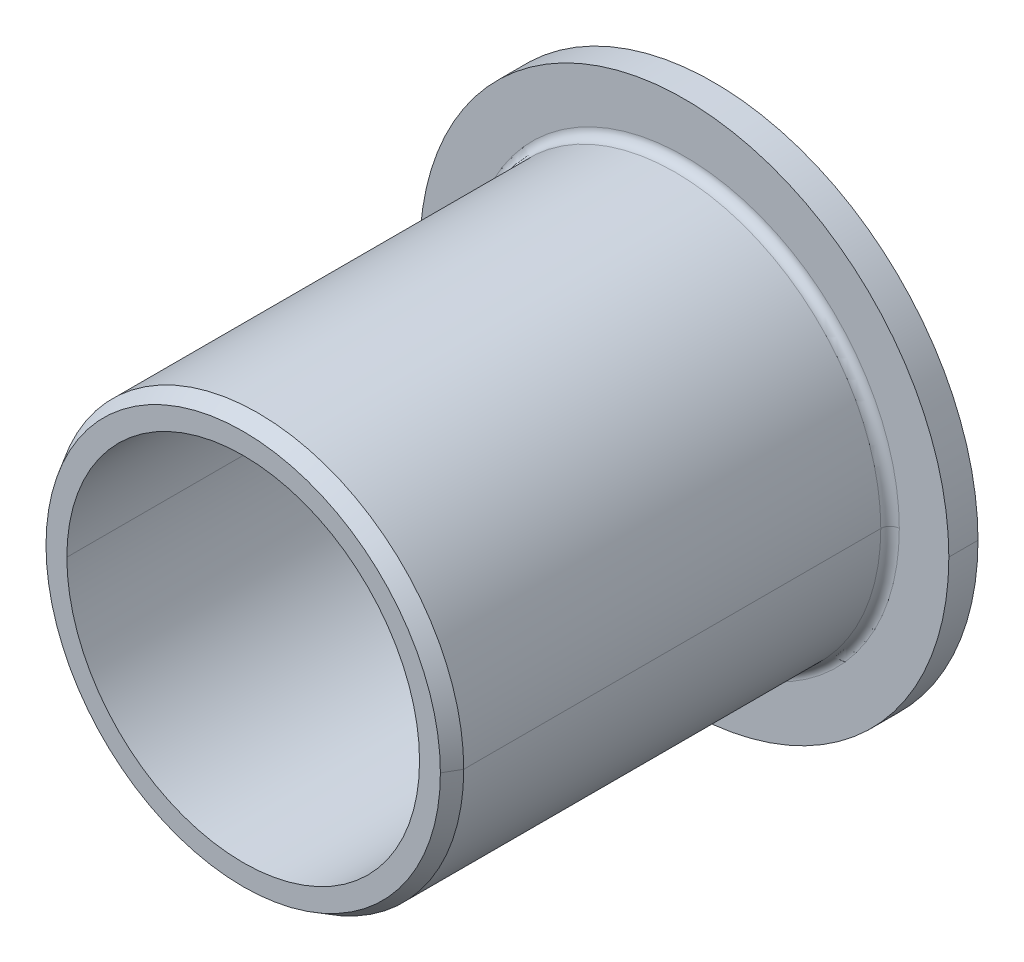
ISO-10303-21;
HEADER;
FILE_DESCRIPTION(('STEP AP214'),'2;1');
FILE_NAME('part.step','',(''),(''),'','','');
FILE_SCHEMA(('AUTOMOTIVE_DESIGN { 1 0 10303 214 1 1 1 1 }'));
ENDSEC;
DATA;
#1=APPLICATION_CONTEXT('core data for automotive mechanical design processes');
#2=APPLICATION_PROTOCOL_DEFINITION('international standard','automotive_design',2000,#1);
#3=PRODUCT_CONTEXT('',#1,'mechanical');
#4=PRODUCT('Part','Part','',(#3));
#5=PRODUCT_RELATED_PRODUCT_CATEGORY('part','',(#4));
#6=PRODUCT_DEFINITION_FORMATION('','',#4);
#7=PRODUCT_DEFINITION_CONTEXT('part definition',#1,'design');
#8=PRODUCT_DEFINITION('design','',#6,#7);
#9=PRODUCT_DEFINITION_SHAPE('','',#8);
#10=(LENGTH_UNIT() NAMED_UNIT(*) SI_UNIT(.MILLI.,.METRE.));
#11=(NAMED_UNIT(*) PLANE_ANGLE_UNIT() SI_UNIT($,.RADIAN.));
#12=(NAMED_UNIT(*) SI_UNIT($,.STERADIAN.) SOLID_ANGLE_UNIT());
#13=UNCERTAINTY_MEASURE_WITH_UNIT(LENGTH_MEASURE(1.E-05),#10,'distance_accuracy_value','');
#14=(GEOMETRIC_REPRESENTATION_CONTEXT(3) GLOBAL_UNCERTAINTY_ASSIGNED_CONTEXT((#13)) GLOBAL_UNIT_ASSIGNED_CONTEXT((#10,
#11,#12)) REPRESENTATION_CONTEXT('',''));
#15=CARTESIAN_POINT('',(0.,0.,0.));
#16=DIRECTION('',(0.,0.,1.));
#17=DIRECTION('',(1.,0.,0.));
#18=AXIS2_PLACEMENT_3D('',#15,#16,#17);
#19=CARTESIAN_POINT('',(11.90625,0.,0.));
#20=DIRECTION('',(0.,0.,-1.));
#21=DIRECTION('',(0.,-1.,0.));
#22=AXIS2_PLACEMENT_3D('',#19,#20,#21);
#23=PLANE('',#22);
#24=CARTESIAN_POINT('',(0.,0.,0.));
#25=DIRECTION('',(0.,0.,1.));
#26=DIRECTION('',(1.,0.,0.));
#27=AXIS2_PLACEMENT_3D('',#24,#25,#26);
#28=CIRCLE('',#27,9.525);
#29=CARTESIAN_POINT('',(9.525,0.,0.));
#30=VERTEX_POINT('',#29);
#31=CARTESIAN_POINT('',(-9.525,0.,0.));
#32=VERTEX_POINT('',#31);
#33=EDGE_CURVE('E10',#30,#32,#28,.T.);
#34=ORIENTED_EDGE('',*,*,#33,.T.);
#35=CARTESIAN_POINT('',(0.,0.,0.));
#36=DIRECTION('',(0.,0.,1.));
#37=DIRECTION('',(1.,0.,0.));
#38=AXIS2_PLACEMENT_3D('',#35,#36,#37);
#39=CIRCLE('',#38,9.525);
#40=EDGE_CURVE('E139',#32,#30,#39,.T.);
#41=ORIENTED_EDGE('',*,*,#40,.T.);
#42=EDGE_LOOP('',(#34,#41));
#43=FACE_BOUND('',#42,.T.);
#44=CARTESIAN_POINT('',(0.,0.,0.));
#45=DIRECTION('',(0.,0.,1.));
#46=DIRECTION('',(1.,0.,0.));
#47=AXIS2_PLACEMENT_3D('',#44,#45,#46);
#48=CIRCLE('',#47,14.2875);
#49=CARTESIAN_POINT('',(14.2875,0.,0.));
#50=VERTEX_POINT('',#49);
#51=CARTESIAN_POINT('',(-14.2875,0.,0.));
#52=VERTEX_POINT('',#51);
#53=EDGE_CURVE('E174',#50,#52,#48,.T.);
#54=ORIENTED_EDGE('',*,*,#53,.F.);
#55=CARTESIAN_POINT('',(0.,0.,0.));
#56=DIRECTION('',(0.,0.,1.));
#57=DIRECTION('',(1.,0.,0.));
#58=AXIS2_PLACEMENT_3D('',#55,#56,#57);
#59=CIRCLE('',#58,14.2875);
#60=EDGE_CURVE('E111',#52,#50,#59,.T.);
#61=ORIENTED_EDGE('',*,*,#60,.F.);
#62=EDGE_LOOP('',(#54,#61));
#63=FACE_BOUND('',#62,.T.);
#64=ADVANCED_FACE('F15',(#43,#63),#23,.T.);
#65=CARTESIAN_POINT('',(0.,0.,12.7));
#66=DIRECTION('',(0.,0.,1.));
#67=DIRECTION('',(1.,0.,0.));
#68=AXIS2_PLACEMENT_3D('',#65,#66,#67);
#69=CYLINDRICAL_SURFACE('',#68,9.525);
#70=DIRECTION('',(0.,0.,1.));
#71=VECTOR('',#70,1.);
#72=CARTESIAN_POINT('',(9.525,0.,12.7));
#73=LINE('',#72,#71);
#74=CARTESIAN_POINT('',(9.525,0.,25.4));
#75=VERTEX_POINT('',#74);
#76=EDGE_CURVE('E148',#30,#75,#73,.T.);
#77=ORIENTED_EDGE('',*,*,#76,.T.);
#78=CARTESIAN_POINT('',(0.,0.,25.4));
#79=DIRECTION('',(0.,0.,1.));
#80=DIRECTION('',(1.,0.,0.));
#81=AXIS2_PLACEMENT_3D('',#78,#79,#80);
#82=CIRCLE('',#81,9.525);
#83=CARTESIAN_POINT('',(-9.525,0.,25.4));
#84=VERTEX_POINT('',#83);
#85=EDGE_CURVE('E26',#75,#84,#82,.T.);
#86=ORIENTED_EDGE('',*,*,#85,.T.);
#87=DIRECTION('',(0.,0.,-1.));
#88=VECTOR('',#87,1.);
#89=CARTESIAN_POINT('',(-9.525,0.,12.7));
#90=LINE('',#89,#88);
#91=EDGE_CURVE('E134',#84,#32,#90,.T.);
#92=ORIENTED_EDGE('',*,*,#91,.T.);
#93=ORIENTED_EDGE('',*,*,#33,.F.);
#94=EDGE_LOOP('',(#77,#86,#92,#93));
#95=FACE_BOUND('',#94,.T.);
#96=ADVANCED_FACE('F227',(#95),#69,.F.);
#97=CARTESIAN_POINT('',(10.0878098923,0.,25.4));
#98=DIRECTION('',(0.,0.,1.));
#99=DIRECTION('',(1.,0.,0.));
#100=AXIS2_PLACEMENT_3D('',#97,#98,#99);
#101=PLANE('',#100);
#102=ORIENTED_EDGE('',*,*,#85,.F.);
#103=CARTESIAN_POINT('',(0.,0.,25.4));
#104=DIRECTION('',(0.,0.,1.));
#105=DIRECTION('',(1.,0.,0.));
#106=AXIS2_PLACEMENT_3D('',#103,#104,#105);
#107=CIRCLE('',#106,9.525);
#108=EDGE_CURVE('E130',#84,#75,#107,.T.);
#109=ORIENTED_EDGE('',*,*,#108,.F.);
#110=EDGE_LOOP('',(#102,#109));
#111=FACE_BOUND('',#110,.T.);
#112=CARTESIAN_POINT('',(0.,0.,25.4));
#113=DIRECTION('',(0.,0.,1.));
#114=DIRECTION('',(1.,0.,0.));
#115=AXIS2_PLACEMENT_3D('',#112,#113,#114);
#116=CIRCLE('',#115,10.6506197846);
#117=CARTESIAN_POINT('',(10.6506197846,0.,25.4));
#118=VERTEX_POINT('',#117);
#119=CARTESIAN_POINT('',(-10.6506197846,0.,25.4));
#120=VERTEX_POINT('',#119);
#121=EDGE_CURVE('E142',#118,#120,#116,.T.);
#122=ORIENTED_EDGE('',*,*,#121,.T.);
#123=CARTESIAN_POINT('',(0.,0.,25.4));
#124=DIRECTION('',(0.,0.,1.));
#125=DIRECTION('',(1.,0.,0.));
#126=AXIS2_PLACEMENT_3D('',#123,#124,#125);
#127=CIRCLE('',#126,10.6506197846);
#128=EDGE_CURVE('E184',#120,#118,#127,.T.);
#129=ORIENTED_EDGE('',*,*,#128,.T.);
#130=EDGE_LOOP('',(#122,#129));
#131=FACE_BOUND('',#130,.T.);
#132=ADVANCED_FACE('F233',(#111,#131),#101,.T.);
#133=CARTESIAN_POINT('',(0.,0.,25.));
#134=DIRECTION('',(0.,0.,-1.));
#135=DIRECTION('',(1.,0.,0.));
#136=AXIS2_PLACEMENT_3D('',#133,#134,#135);
#137=CONICAL_SURFACE('',#136,10.8815598923,0.523598775643582);
#138=DIRECTION('',(-0.500000000039216,0.,0.866025403761797));
#139=VECTOR('',#138,1.);
#140=CARTESIAN_POINT('',(10.8815598923,0.,25.));
#141=LINE('',#140,#139);
#142=CARTESIAN_POINT('',(11.1125,0.,24.6));
#143=VERTEX_POINT('',#142);
#144=EDGE_CURVE('E133',#143,#118,#141,.T.);
#145=ORIENTED_EDGE('',*,*,#144,.T.);
#146=ORIENTED_EDGE('',*,*,#128,.F.);
#147=DIRECTION('',(-0.500000000039216,0.,-0.866025403761797));
#148=VECTOR('',#147,1.);
#149=CARTESIAN_POINT('',(-10.8815598923,0.,25.));
#150=LINE('',#149,#148);
#151=CARTESIAN_POINT('',(-11.1125,0.,24.6));
#152=VERTEX_POINT('',#151);
#153=EDGE_CURVE('E147',#120,#152,#150,.T.);
#154=ORIENTED_EDGE('',*,*,#153,.T.);
#155=CARTESIAN_POINT('',(0.,0.,24.6));
#156=DIRECTION('',(0.,0.,1.));
#157=DIRECTION('',(1.,0.,0.));
#158=AXIS2_PLACEMENT_3D('',#155,#156,#157);
#159=CIRCLE('',#158,11.1125);
#160=EDGE_CURVE('E110',#152,#143,#159,.T.);
#161=ORIENTED_EDGE('',*,*,#160,.T.);
#162=EDGE_LOOP('',(#145,#146,#154,#161));
#163=FACE_BOUND('',#162,.T.);
#164=ADVANCED_FACE('F251',(#163),#137,.T.);
#165=CARTESIAN_POINT('',(0.,0.,13.3374));
#166=DIRECTION('',(0.,0.,1.));
#167=DIRECTION('',(1.,0.,0.));
#168=AXIS2_PLACEMENT_3D('',#165,#166,#167);
#169=CYLINDRICAL_SURFACE('',#168,11.1125);
#170=DIRECTION('',(0.,0.,1.));
#171=VECTOR('',#170,1.);
#172=CARTESIAN_POINT('',(11.1125,0.,13.3374));
#173=LINE('',#172,#171);
#174=CARTESIAN_POINT('',(11.1125,0.,2.0748));
#175=VERTEX_POINT('',#174);
#176=EDGE_CURVE('E146',#175,#143,#173,.T.);
#177=ORIENTED_EDGE('',*,*,#176,.T.);
#178=ORIENTED_EDGE('',*,*,#160,.F.);
#179=DIRECTION('',(0.,0.,-1.));
#180=VECTOR('',#179,1.);
#181=CARTESIAN_POINT('',(-11.1125,0.,13.3374));
#182=LINE('',#181,#180);
#183=CARTESIAN_POINT('',(-11.1125,0.,2.0748));
#184=VERTEX_POINT('',#183);
#185=EDGE_CURVE('E119',#152,#184,#182,.T.);
#186=ORIENTED_EDGE('',*,*,#185,.T.);
#187=CARTESIAN_POINT('',(0.,0.,2.0748));
#188=DIRECTION('',(0.,0.,1.));
#189=DIRECTION('',(1.,0.,0.));
#190=AXIS2_PLACEMENT_3D('',#187,#188,#189);
#191=CIRCLE('',#190,11.1125);
#192=EDGE_CURVE('E117',#184,#175,#191,.T.);
#193=ORIENTED_EDGE('',*,*,#192,.T.);
#194=EDGE_LOOP('',(#177,#178,#186,#193));
#195=FACE_BOUND('',#194,.T.);
#196=ADVANCED_FACE('F224',(#195),#169,.T.);
#197=CARTESIAN_POINT('',(0.,0.,2.0748));
#198=DIRECTION('',(0.,0.,1.));
#199=DIRECTION('',(1.,0.,0.));
#200=AXIS2_PLACEMENT_3D('',#197,#198,#199);
#201=TOROIDAL_SURFACE('',#200,11.6125,0.5);
#202=CARTESIAN_POINT('',(-11.6125,0.,2.0748));
#203=DIRECTION('',(0.,-1.,0.));
#204=DIRECTION('',(-1.,0.,0.));
#205=AXIS2_PLACEMENT_3D('',#202,#203,#204);
#206=CIRCLE('',#205,0.5);
#207=CARTESIAN_POINT('',(-11.6125,0.,1.5748));
#208=VERTEX_POINT('',#207);
#209=EDGE_CURVE('E103',#208,#184,#206,.T.);
#210=ORIENTED_EDGE('',*,*,#209,.T.);
#211=CARTESIAN_POINT('',(0.,0.,2.0748));
#212=DIRECTION('',(0.,0.,1.));
#213=DIRECTION('',(1.,0.,0.));
#214=AXIS2_PLACEMENT_3D('',#211,#212,#213);
#215=CIRCLE('',#214,11.1125);
#216=EDGE_CURVE('E125',#175,#184,#215,.T.);
#217=ORIENTED_EDGE('',*,*,#216,.F.);
#218=CARTESIAN_POINT('',(11.6125,0.,2.0748));
#219=DIRECTION('',(0.,-1.,0.));
#220=DIRECTION('',(1.,0.,0.));
#221=AXIS2_PLACEMENT_3D('',#218,#219,#220);
#222=CIRCLE('',#221,0.5);
#223=CARTESIAN_POINT('',(11.6125,0.,1.5748));
#224=VERTEX_POINT('',#223);
#225=EDGE_CURVE('E106',#175,#224,#222,.T.);
#226=ORIENTED_EDGE('',*,*,#225,.T.);
#227=CARTESIAN_POINT('',(0.,0.,1.5748));
#228=DIRECTION('',(0.,0.,1.));
#229=DIRECTION('',(1.,0.,0.));
#230=AXIS2_PLACEMENT_3D('',#227,#228,#229);
#231=CIRCLE('',#230,11.6125);
#232=EDGE_CURVE('E98',#224,#208,#231,.T.);
#233=ORIENTED_EDGE('',*,*,#232,.T.);
#234=EDGE_LOOP('',(#210,#217,#226,#233));
#235=FACE_BOUND('',#234,.T.);
#236=ADVANCED_FACE('F100',(#235),#201,.F.);
#237=CARTESIAN_POINT('',(12.95,0.,1.5748));
#238=DIRECTION('',(0.,0.,1.));
#239=DIRECTION('',(1.,0.,0.));
#240=AXIS2_PLACEMENT_3D('',#237,#238,#239);
#241=PLANE('',#240);
#242=ORIENTED_EDGE('',*,*,#232,.F.);
#243=CARTESIAN_POINT('',(0.,0.,1.5748));
#244=DIRECTION('',(0.,0.,1.));
#245=DIRECTION('',(1.,0.,0.));
#246=AXIS2_PLACEMENT_3D('',#243,#244,#245);
#247=CIRCLE('',#246,11.6125);
#248=EDGE_CURVE('E19',#208,#224,#247,.T.);
#249=ORIENTED_EDGE('',*,*,#248,.F.);
#250=EDGE_LOOP('',(#242,#249));
#251=FACE_BOUND('',#250,.T.);
#252=CARTESIAN_POINT('',(0.,0.,1.5748));
#253=DIRECTION('',(0.,0.,1.));
#254=DIRECTION('',(1.,0.,0.));
#255=AXIS2_PLACEMENT_3D('',#252,#253,#254);
#256=CIRCLE('',#255,14.2875);
#257=CARTESIAN_POINT('',(14.2875,0.,1.5748));
#258=VERTEX_POINT('',#257);
#259=CARTESIAN_POINT('',(-14.2875,0.,1.5748));
#260=VERTEX_POINT('',#259);
#261=EDGE_CURVE('E182',#258,#260,#256,.T.);
#262=ORIENTED_EDGE('',*,*,#261,.T.);
#263=CARTESIAN_POINT('',(0.,0.,1.5748));
#264=DIRECTION('',(0.,0.,1.));
#265=DIRECTION('',(1.,0.,0.));
#266=AXIS2_PLACEMENT_3D('',#263,#264,#265);
#267=CIRCLE('',#266,14.2875);
#268=EDGE_CURVE('E39',#260,#258,#267,.T.);
#269=ORIENTED_EDGE('',*,*,#268,.T.);
#270=EDGE_LOOP('',(#262,#269));
#271=FACE_BOUND('',#270,.T.);
#272=ADVANCED_FACE('F17',(#251,#271),#241,.T.);
#273=CARTESIAN_POINT('',(0.,0.,0.7874));
#274=DIRECTION('',(0.,0.,1.));
#275=DIRECTION('',(1.,0.,0.));
#276=AXIS2_PLACEMENT_3D('',#273,#274,#275);
#277=CYLINDRICAL_SURFACE('',#276,14.2875);
#278=DIRECTION('',(0.,0.,1.));
#279=VECTOR('',#278,1.);
#280=CARTESIAN_POINT('',(14.2875,0.,0.7874));
#281=LINE('',#280,#279);
#282=EDGE_CURVE('E179',#50,#258,#281,.T.);
#283=ORIENTED_EDGE('',*,*,#282,.T.);
#284=ORIENTED_EDGE('',*,*,#268,.F.);
#285=DIRECTION('',(0.,0.,-1.));
#286=VECTOR('',#285,1.);
#287=CARTESIAN_POINT('',(-14.2875,0.,0.7874));
#288=LINE('',#287,#286);
#289=EDGE_CURVE('E178',#260,#52,#288,.T.);
#290=ORIENTED_EDGE('',*,*,#289,.T.);
#291=ORIENTED_EDGE('',*,*,#60,.T.);
#292=EDGE_LOOP('',(#283,#284,#290,#291));
#293=FACE_BOUND('',#292,.T.);
#294=ADVANCED_FACE('F211',(#293),#277,.T.);
#295=CARTESIAN_POINT('',(0.,0.,0.7874));
#296=DIRECTION('',(0.,0.,1.));
#297=DIRECTION('',(1.,0.,0.));
#298=AXIS2_PLACEMENT_3D('',#295,#296,#297);
#299=CYLINDRICAL_SURFACE('',#298,14.2875);
#300=ORIENTED_EDGE('',*,*,#282,.F.);
#301=ORIENTED_EDGE('',*,*,#53,.T.);
#302=ORIENTED_EDGE('',*,*,#289,.F.);
#303=ORIENTED_EDGE('',*,*,#261,.F.);
#304=EDGE_LOOP('',(#300,#301,#302,#303));
#305=FACE_BOUND('',#304,.T.);
#306=ADVANCED_FACE('F215',(#305),#299,.T.);
#307=CARTESIAN_POINT('',(0.,0.,2.0748));
#308=DIRECTION('',(0.,0.,1.));
#309=DIRECTION('',(1.,0.,0.));
#310=AXIS2_PLACEMENT_3D('',#307,#308,#309);
#311=TOROIDAL_SURFACE('',#310,11.6125,0.5);
#312=ORIENTED_EDGE('',*,*,#209,.F.);
#313=ORIENTED_EDGE('',*,*,#248,.T.);
#314=ORIENTED_EDGE('',*,*,#225,.F.);
#315=ORIENTED_EDGE('',*,*,#192,.F.);
#316=EDGE_LOOP('',(#312,#313,#314,#315));
#317=FACE_BOUND('',#316,.T.);
#318=ADVANCED_FACE('F116',(#317),#311,.F.);
#319=CARTESIAN_POINT('',(0.,0.,13.3374));
#320=DIRECTION('',(0.,0.,1.));
#321=DIRECTION('',(1.,0.,0.));
#322=AXIS2_PLACEMENT_3D('',#319,#320,#321);
#323=CYLINDRICAL_SURFACE('',#322,11.1125);
#324=ORIENTED_EDGE('',*,*,#176,.F.);
#325=ORIENTED_EDGE('',*,*,#216,.T.);
#326=ORIENTED_EDGE('',*,*,#185,.F.);
#327=CARTESIAN_POINT('',(0.,0.,24.6));
#328=DIRECTION('',(0.,0.,1.));
#329=DIRECTION('',(1.,0.,0.));
#330=AXIS2_PLACEMENT_3D('',#327,#328,#329);
#331=CIRCLE('',#330,11.1125);
#332=EDGE_CURVE('E155',#143,#152,#331,.T.);
#333=ORIENTED_EDGE('',*,*,#332,.F.);
#334=EDGE_LOOP('',(#324,#325,#326,#333));
#335=FACE_BOUND('',#334,.T.);
#336=ADVANCED_FACE('F237',(#335),#323,.T.);
#337=CARTESIAN_POINT('',(0.,0.,25.));
#338=DIRECTION('',(0.,0.,-1.));
#339=DIRECTION('',(1.,0.,0.));
#340=AXIS2_PLACEMENT_3D('',#337,#338,#339);
#341=CONICAL_SURFACE('',#340,10.8815598923,0.523598775643582);
#342=ORIENTED_EDGE('',*,*,#144,.F.);
#343=ORIENTED_EDGE('',*,*,#332,.T.);
#344=ORIENTED_EDGE('',*,*,#153,.F.);
#345=ORIENTED_EDGE('',*,*,#121,.F.);
#346=EDGE_LOOP('',(#342,#343,#344,#345));
#347=FACE_BOUND('',#346,.T.);
#348=ADVANCED_FACE('F243',(#347),#341,.T.);
#349=CARTESIAN_POINT('',(0.,0.,12.7));
#350=DIRECTION('',(0.,0.,1.));
#351=DIRECTION('',(1.,0.,0.));
#352=AXIS2_PLACEMENT_3D('',#349,#350,#351);
#353=CYLINDRICAL_SURFACE('',#352,9.525);
#354=ORIENTED_EDGE('',*,*,#76,.F.);
#355=ORIENTED_EDGE('',*,*,#40,.F.);
#356=ORIENTED_EDGE('',*,*,#91,.F.);
#357=ORIENTED_EDGE('',*,*,#108,.T.);
#358=EDGE_LOOP('',(#354,#355,#356,#357));
#359=FACE_BOUND('',#358,.T.);
#360=ADVANCED_FACE('F258',(#359),#353,.F.);
#361=CLOSED_SHELL('',(#64,#96,#132,#164,#196,#236,#272,#294,#306,#318,#336,#348,#360));
#362=MANIFOLD_SOLID_BREP('B1',#361);
#363=ADVANCED_BREP_SHAPE_REPRESENTATION('',(#18,#362),#14);
#364=SHAPE_DEFINITION_REPRESENTATION(#9,#363);
ENDSEC;
END-ISO-10303-21;
